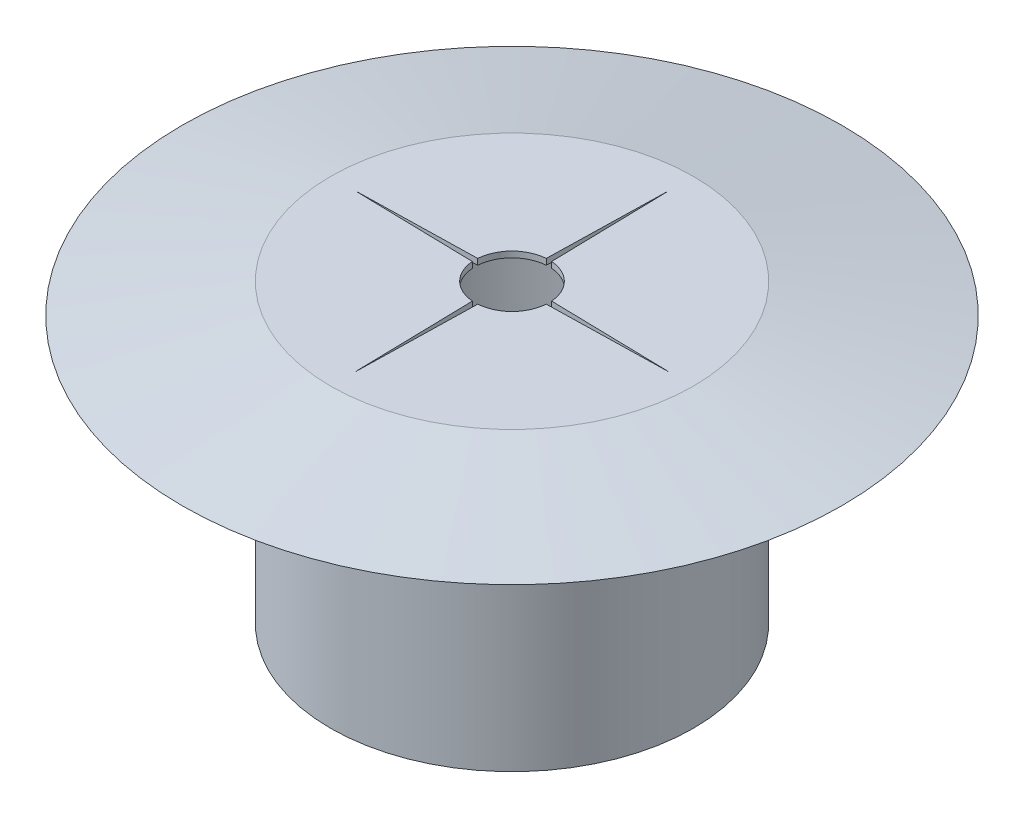
ISO-10303-21;
HEADER;
FILE_DESCRIPTION(('STEP AP214'),'2;1');
FILE_NAME('part.step','',(''),(''),'','','');
FILE_SCHEMA(('AUTOMOTIVE_DESIGN { 1 0 10303 214 1 1 1 1 }'));
ENDSEC;
DATA;
#1=APPLICATION_CONTEXT('core data for automotive mechanical design processes');
#2=APPLICATION_PROTOCOL_DEFINITION('international standard','automotive_design',2000,#1);
#3=PRODUCT_CONTEXT('',#1,'mechanical');
#4=PRODUCT('Part','Part','',(#3));
#5=PRODUCT_RELATED_PRODUCT_CATEGORY('part','',(#4));
#6=PRODUCT_DEFINITION_FORMATION('','',#4);
#7=PRODUCT_DEFINITION_CONTEXT('part definition',#1,'design');
#8=PRODUCT_DEFINITION('design','',#6,#7);
#9=PRODUCT_DEFINITION_SHAPE('','',#8);
#10=(LENGTH_UNIT() NAMED_UNIT(*) SI_UNIT(.MILLI.,.METRE.));
#11=(NAMED_UNIT(*) PLANE_ANGLE_UNIT() SI_UNIT($,.RADIAN.));
#12=(NAMED_UNIT(*) SI_UNIT($,.STERADIAN.) SOLID_ANGLE_UNIT());
#13=UNCERTAINTY_MEASURE_WITH_UNIT(LENGTH_MEASURE(1.E-05),#10,'distance_accuracy_value','');
#14=(GEOMETRIC_REPRESENTATION_CONTEXT(3) GLOBAL_UNCERTAINTY_ASSIGNED_CONTEXT((#13)) GLOBAL_UNIT_ASSIGNED_CONTEXT((#10,
#11,#12)) REPRESENTATION_CONTEXT('',''));
#15=CARTESIAN_POINT('',(0.,0.,0.));
#16=DIRECTION('',(0.,0.,1.));
#17=DIRECTION('',(1.,0.,0.));
#18=AXIS2_PLACEMENT_3D('',#15,#16,#17);
#19=CARTESIAN_POINT('',(0.,0.,0.));
#20=DIRECTION('',(0.,-1.,0.));
#21=DIRECTION('',(0.,0.,-1.));
#22=AXIS2_PLACEMENT_3D('',#19,#20,#21);
#23=CYLINDRICAL_SURFACE('',#22,10.9);
#24=CARTESIAN_POINT('',(0.,0.,0.));
#25=DIRECTION('',(0.,-1.,0.));
#26=DIRECTION('',(0.,0.,-1.));
#27=AXIS2_PLACEMENT_3D('',#24,#25,#26);
#28=CIRCLE('',#27,10.9);
#29=CARTESIAN_POINT('',(0.,0.,-10.9));
#30=VERTEX_POINT('',#29);
#31=EDGE_CURVE('E44',#30,#30,#28,.T.);
#32=ORIENTED_EDGE('',*,*,#31,.T.);
#33=EDGE_LOOP('',(#32));
#34=FACE_BOUND('',#33,.T.);
#35=CARTESIAN_POINT('',(0.,19.6,0.));
#36=DIRECTION('',(0.,1.,0.));
#37=DIRECTION('',(0.,0.,1.));
#38=AXIS2_PLACEMENT_3D('',#35,#36,#37);
#39=CIRCLE('',#38,10.9);
#40=CARTESIAN_POINT('',(0.,19.6,10.9));
#41=VERTEX_POINT('',#40);
#42=EDGE_CURVE('E11',#41,#41,#39,.F.);
#43=ORIENTED_EDGE('',*,*,#42,.F.);
#44=EDGE_LOOP('',(#43));
#45=FACE_BOUND('',#44,.T.);
#46=ADVANCED_FACE('F35',(#34,#45),#23,.F.);
#47=CARTESIAN_POINT('',(-12.25,20.,0.));
#48=DIRECTION('',(0.,-1.,0.));
#49=DIRECTION('',(0.,0.,-1.));
#50=AXIS2_PLACEMENT_3D('',#47,#48,#49);
#51=PLANE('',#50);
#52=CARTESIAN_POINT('',(0.,20.,0.));
#53=DIRECTION('',(0.,-1.,0.));
#54=DIRECTION('',(0.,0.,-1.));
#55=AXIS2_PLACEMENT_3D('',#52,#53,#54);
#56=CIRCLE('',#55,12.25);
#57=CARTESIAN_POINT('',(0.,20.,-12.25));
#58=VERTEX_POINT('',#57);
#59=EDGE_CURVE('E190',#58,#58,#56,.T.);
#60=ORIENTED_EDGE('',*,*,#59,.F.);
#61=EDGE_LOOP('',(#60));
#62=FACE_BOUND('',#61,.T.);
#63=DIRECTION('',(-0.0222490233701665,0.,-0.999752459841472));
#64=VECTOR('',#63,1.);
#65=CARTESIAN_POINT('',(0.236666949150214,20.,-0.00526691225488365));
#66=LINE('',#65,#64);
#67=CARTESIAN_POINT('',(0.181294314743964,20.,-2.49341780924127));
#68=VERTEX_POINT('',#67);
#69=CARTESIAN_POINT('',(0.,20.,-10.6398175008156));
#70=VERTEX_POINT('',#69);
#71=EDGE_CURVE('E157',#68,#70,#66,.T.);
#72=ORIENTED_EDGE('',*,*,#71,.F.);
#73=CARTESIAN_POINT('',(0.,20.,0.));
#74=DIRECTION('',(0.,1.,0.));
#75=DIRECTION('',(0.,0.,1.));
#76=AXIS2_PLACEMENT_3D('',#73,#74,#75);
#77=CIRCLE('',#76,2.5);
#78=CARTESIAN_POINT('',(2.49341780924127,20.,-0.181294314743965));
#79=VERTEX_POINT('',#78);
#80=EDGE_CURVE('E159',#68,#79,#77,.F.);
#81=ORIENTED_EDGE('',*,*,#80,.T.);
#82=DIRECTION('',(0.999752459841472,0.,0.0222490233701668));
#83=VECTOR('',#82,1.);
#84=CARTESIAN_POINT('',(0.00526691225488376,20.,-0.236666949150216));
#85=LINE('',#84,#83);
#86=CARTESIAN_POINT('',(10.6398175008156,20.,0.));
#87=VERTEX_POINT('',#86);
#88=EDGE_CURVE('E162',#79,#87,#85,.T.);
#89=ORIENTED_EDGE('',*,*,#88,.T.);
#90=DIRECTION('',(0.999752459841472,0.,-0.0222490233701658));
#91=VECTOR('',#90,1.);
#92=CARTESIAN_POINT('',(0.00526691225488346,20.,0.236666949150212));
#93=LINE('',#92,#91);
#94=CARTESIAN_POINT('',(2.49341780924127,20.,0.181294314743964));
#95=VERTEX_POINT('',#94);
#96=EDGE_CURVE('E165',#95,#87,#93,.T.);
#97=ORIENTED_EDGE('',*,*,#96,.F.);
#98=CARTESIAN_POINT('',(0.,20.,0.));
#99=DIRECTION('',(0.,1.,0.));
#100=DIRECTION('',(0.,0.,1.));
#101=AXIS2_PLACEMENT_3D('',#98,#99,#100);
#102=CIRCLE('',#101,2.50000000000002);
#103=CARTESIAN_POINT('',(0.181294314743965,20.,2.49341780924127));
#104=VERTEX_POINT('',#103);
#105=EDGE_CURVE('E168',#95,#104,#102,.F.);
#106=ORIENTED_EDGE('',*,*,#105,.T.);
#107=DIRECTION('',(-0.0222490233701662,0.,0.999752459841472));
#108=VECTOR('',#107,1.);
#109=CARTESIAN_POINT('',(0.236666949150214,20.,0.00526691225488356));
#110=LINE('',#109,#108);
#111=CARTESIAN_POINT('',(0.,20.,10.6398175008156));
#112=VERTEX_POINT('',#111);
#113=EDGE_CURVE('E171',#104,#112,#110,.T.);
#114=ORIENTED_EDGE('',*,*,#113,.T.);
#115=DIRECTION('',(0.0222490233701664,0.,0.999752459841472));
#116=VECTOR('',#115,1.);
#117=CARTESIAN_POINT('',(-0.236666949150214,20.,0.00526691225488362));
#118=LINE('',#117,#116);
#119=CARTESIAN_POINT('',(-0.181294314743964,20.,2.49341780924127));
#120=VERTEX_POINT('',#119);
#121=EDGE_CURVE('E174',#120,#112,#118,.T.);
#122=ORIENTED_EDGE('',*,*,#121,.F.);
#123=CARTESIAN_POINT('',(0.,20.,0.));
#124=DIRECTION('',(0.,1.,0.));
#125=DIRECTION('',(0.,0.,1.));
#126=AXIS2_PLACEMENT_3D('',#123,#124,#125);
#127=CIRCLE('',#126,2.5);
#128=CARTESIAN_POINT('',(-2.49341780924127,20.,0.181294314743965));
#129=VERTEX_POINT('',#128);
#130=EDGE_CURVE('E177',#120,#129,#127,.F.);
#131=ORIENTED_EDGE('',*,*,#130,.T.);
#132=DIRECTION('',(-0.999752459841472,0.,-0.0222490233701661));
#133=VECTOR('',#132,1.);
#134=CARTESIAN_POINT('',(-0.00526691225488354,20.,0.236666949150214));
#135=LINE('',#134,#133);
#136=CARTESIAN_POINT('',(-10.6398175008156,20.,0.));
#137=VERTEX_POINT('',#136);
#138=EDGE_CURVE('E180',#129,#137,#135,.T.);
#139=ORIENTED_EDGE('',*,*,#138,.T.);
#140=DIRECTION('',(-0.999752459841472,0.,0.0222490233701665));
#141=VECTOR('',#140,1.);
#142=CARTESIAN_POINT('',(-0.00526691225488363,20.,-0.236666949150214));
#143=LINE('',#142,#141);
#144=CARTESIAN_POINT('',(-2.49341780924127,20.,-0.181294314743964));
#145=VERTEX_POINT('',#144);
#146=EDGE_CURVE('E183',#145,#137,#143,.T.);
#147=ORIENTED_EDGE('',*,*,#146,.F.);
#148=CARTESIAN_POINT('',(0.,20.,0.));
#149=DIRECTION('',(0.,1.,0.));
#150=DIRECTION('',(0.,0.,1.));
#151=AXIS2_PLACEMENT_3D('',#148,#149,#150);
#152=CIRCLE('',#151,2.49999999999997);
#153=CARTESIAN_POINT('',(-0.181294314743965,20.,-2.49341780924127));
#154=VERTEX_POINT('',#153);
#155=EDGE_CURVE('E138',#145,#154,#152,.F.);
#156=ORIENTED_EDGE('',*,*,#155,.T.);
#157=DIRECTION('',(0.022249023370166,0.,-0.999752459841472));
#158=VECTOR('',#157,1.);
#159=CARTESIAN_POINT('',(-0.236666949150214,20.,-0.00526691225488353));
#160=LINE('',#159,#158);
#161=EDGE_CURVE('E186',#154,#70,#160,.T.);
#162=ORIENTED_EDGE('',*,*,#161,.T.);
#163=EDGE_LOOP('',(#72,#81,#89,#97,#106,#114,#122,#131,#139,#147,#156,#162));
#164=FACE_BOUND('',#163,.T.);
#165=ADVANCED_FACE('F37',(#62,#164),#51,.F.);
#166=CARTESIAN_POINT('',(-10.9,0.,0.));
#167=DIRECTION('',(0.,1.,0.));
#168=DIRECTION('',(0.,0.,1.));
#169=AXIS2_PLACEMENT_3D('',#166,#167,#168);
#170=PLANE('',#169);
#171=ORIENTED_EDGE('',*,*,#31,.F.);
#172=EDGE_LOOP('',(#171));
#173=FACE_BOUND('',#172,.T.);
#174=CARTESIAN_POINT('',(0.,0.,0.));
#175=DIRECTION('',(0.,-1.,0.));
#176=DIRECTION('',(0.,0.,-1.));
#177=AXIS2_PLACEMENT_3D('',#174,#175,#176);
#178=CIRCLE('',#177,12.25);
#179=CARTESIAN_POINT('',(0.,0.,-12.25));
#180=VERTEX_POINT('',#179);
#181=EDGE_CURVE('E216',#180,#180,#178,.T.);
#182=ORIENTED_EDGE('',*,*,#181,.T.);
#183=EDGE_LOOP('',(#182));
#184=FACE_BOUND('',#183,.T.);
#185=ADVANCED_FACE('F223',(#173,#184),#170,.F.);
#186=CARTESIAN_POINT('',(0.,0.,0.));
#187=DIRECTION('',(0.,-1.,0.));
#188=DIRECTION('',(0.,0.,-1.));
#189=AXIS2_PLACEMENT_3D('',#186,#187,#188);
#190=CYLINDRICAL_SURFACE('',#189,12.25);
#191=ORIENTED_EDGE('',*,*,#181,.F.);
#192=EDGE_LOOP('',(#191));
#193=FACE_BOUND('',#192,.T.);
#194=CARTESIAN_POINT('',(0.,18.,0.));
#195=DIRECTION('',(0.,-1.,0.));
#196=DIRECTION('',(0.,0.,-1.));
#197=AXIS2_PLACEMENT_3D('',#194,#195,#196);
#198=CIRCLE('',#197,12.25);
#199=CARTESIAN_POINT('',(0.,18.,-12.25));
#200=VERTEX_POINT('',#199);
#201=EDGE_CURVE('E213',#200,#200,#198,.T.);
#202=ORIENTED_EDGE('',*,*,#201,.T.);
#203=EDGE_LOOP('',(#202));
#204=FACE_BOUND('',#203,.T.);
#205=ADVANCED_FACE('F226',(#193,#204),#190,.T.);
#206=CARTESIAN_POINT('',(-12.25,18.,0.));
#207=DIRECTION('',(0.,1.,0.));
#208=DIRECTION('',(0.,0.,1.));
#209=AXIS2_PLACEMENT_3D('',#206,#207,#208);
#210=PLANE('',#209);
#211=ORIENTED_EDGE('',*,*,#201,.F.);
#212=EDGE_LOOP('',(#211));
#213=FACE_BOUND('',#212,.T.);
#214=CARTESIAN_POINT('',(0.,18.,0.));
#215=DIRECTION('',(0.,-1.,0.));
#216=DIRECTION('',(0.,0.,-1.));
#217=AXIS2_PLACEMENT_3D('',#214,#215,#216);
#218=CIRCLE('',#217,22.25);
#219=CARTESIAN_POINT('',(0.,18.,-22.25));
#220=VERTEX_POINT('',#219);
#221=EDGE_CURVE('E210',#220,#220,#218,.T.);
#222=ORIENTED_EDGE('',*,*,#221,.T.);
#223=EDGE_LOOP('',(#222));
#224=FACE_BOUND('',#223,.T.);
#225=ADVANCED_FACE('F232',(#213,#224),#210,.F.);
#226=CARTESIAN_POINT('',(0.,20.,0.));
#227=DIRECTION('',(0.,-1.,0.));
#228=DIRECTION('',(0.,0.,-1.));
#229=AXIS2_PLACEMENT_3D('',#226,#227,#228);
#230=CONICAL_SURFACE('',#229,12.25,1.37340076694502);
#231=ORIENTED_EDGE('',*,*,#221,.F.);
#232=EDGE_LOOP('',(#231));
#233=FACE_BOUND('',#232,.T.);
#234=ORIENTED_EDGE('',*,*,#59,.T.);
#235=EDGE_LOOP('',(#234));
#236=FACE_BOUND('',#235,.T.);
#237=ADVANCED_FACE('F238',(#233,#236),#230,.T.);
#238=CARTESIAN_POINT('',(0.236666949150214,19.6,-0.00526691225488365));
#239=DIRECTION('',(0.999752459841472,0.,-0.0222490233701665));
#240=DIRECTION('',(-0.0222490233701665,0.,-0.999752459841472));
#241=AXIS2_PLACEMENT_3D('',#238,#239,#240);
#242=PLANE('',#241);
#243=ORIENTED_EDGE('',*,*,#71,.T.);
#244=DIRECTION('',(0.,1.,0.));
#245=VECTOR('',#244,1.);
#246=CARTESIAN_POINT('',(0.,19.6,-10.6398175008156));
#247=LINE('',#246,#245);
#248=CARTESIAN_POINT('',(0.,19.6,-10.6398175008156));
#249=VERTEX_POINT('',#248);
#250=EDGE_CURVE('E100',#249,#70,#247,.T.);
#251=ORIENTED_EDGE('',*,*,#250,.F.);
#252=DIRECTION('',(-0.0222490233701665,0.,-0.999752459841472));
#253=VECTOR('',#252,1.);
#254=CARTESIAN_POINT('',(0.236666949150214,19.6,-0.00526691225488365));
#255=LINE('',#254,#253);
#256=CARTESIAN_POINT('',(0.181294314743964,19.6,-2.49341780924127));
#257=VERTEX_POINT('',#256);
#258=EDGE_CURVE('E52',#257,#249,#255,.T.);
#259=ORIENTED_EDGE('',*,*,#258,.F.);
#260=DIRECTION('',(0.,1.,0.));
#261=VECTOR('',#260,1.);
#262=CARTESIAN_POINT('',(0.181294314743964,19.6,-2.49341780924127));
#263=LINE('',#262,#261);
#264=EDGE_CURVE('E108',#257,#68,#263,.T.);
#265=ORIENTED_EDGE('',*,*,#264,.T.);
#266=EDGE_LOOP('',(#243,#251,#259,#265));
#267=FACE_BOUND('',#266,.T.);
#268=ADVANCED_FACE('F244',(#267),#242,.F.);
#269=CARTESIAN_POINT('',(-0.236666949150214,19.6,-0.00526691225488353));
#270=DIRECTION('',(0.999752459841472,0.,0.022249023370166));
#271=DIRECTION('',(0.022249023370166,0.,-0.999752459841472));
#272=AXIS2_PLACEMENT_3D('',#269,#270,#271);
#273=PLANE('',#272);
#274=ORIENTED_EDGE('',*,*,#161,.F.);
#275=DIRECTION('',(0.,1.,0.));
#276=VECTOR('',#275,1.);
#277=CARTESIAN_POINT('',(-0.181294314743965,19.6,-2.49341780924127));
#278=LINE('',#277,#276);
#279=CARTESIAN_POINT('',(-0.181294314743965,19.6,-2.49341780924127));
#280=VERTEX_POINT('',#279);
#281=EDGE_CURVE('E93',#280,#154,#278,.T.);
#282=ORIENTED_EDGE('',*,*,#281,.F.);
#283=DIRECTION('',(0.022249023370166,0.,-0.999752459841472));
#284=VECTOR('',#283,1.);
#285=CARTESIAN_POINT('',(-0.236666949150214,19.6,-0.00526691225488353));
#286=LINE('',#285,#284);
#287=EDGE_CURVE('E152',#280,#249,#286,.T.);
#288=ORIENTED_EDGE('',*,*,#287,.T.);
#289=ORIENTED_EDGE('',*,*,#250,.T.);
#290=EDGE_LOOP('',(#274,#282,#288,#289));
#291=FACE_BOUND('',#290,.T.);
#292=ADVANCED_FACE('F287',(#291),#273,.T.);
#293=CARTESIAN_POINT('',(0.,19.6,0.));
#294=DIRECTION('',(0.,1.,0.));
#295=DIRECTION('',(0.,0.,1.));
#296=AXIS2_PLACEMENT_3D('',#293,#294,#295);
#297=CYLINDRICAL_SURFACE('',#296,2.49999999999997);
#298=ORIENTED_EDGE('',*,*,#155,.F.);
#299=DIRECTION('',(0.,1.,0.));
#300=VECTOR('',#299,1.);
#301=CARTESIAN_POINT('',(-2.49341780924127,19.6,-0.181294314743964));
#302=LINE('',#301,#300);
#303=CARTESIAN_POINT('',(-2.49341780924127,19.6,-0.181294314743964));
#304=VERTEX_POINT('',#303);
#305=EDGE_CURVE('E133',#304,#145,#302,.T.);
#306=ORIENTED_EDGE('',*,*,#305,.F.);
#307=CARTESIAN_POINT('',(0.,19.6,0.));
#308=DIRECTION('',(0.,1.,0.));
#309=DIRECTION('',(0.,0.,1.));
#310=AXIS2_PLACEMENT_3D('',#307,#308,#309);
#311=CIRCLE('',#310,2.49999999999997);
#312=EDGE_CURVE('E137',#304,#280,#311,.F.);
#313=ORIENTED_EDGE('',*,*,#312,.T.);
#314=ORIENTED_EDGE('',*,*,#281,.T.);
#315=EDGE_LOOP('',(#298,#306,#313,#314));
#316=FACE_BOUND('',#315,.T.);
#317=ADVANCED_FACE('F135',(#316),#297,.F.);
#318=CARTESIAN_POINT('',(-0.00526691225488363,19.6,-0.236666949150214));
#319=DIRECTION('',(-0.0222490233701665,0.,-0.999752459841472));
#320=DIRECTION('',(-0.999752459841472,0.,0.0222490233701665));
#321=AXIS2_PLACEMENT_3D('',#318,#319,#320);
#322=PLANE('',#321);
#323=ORIENTED_EDGE('',*,*,#146,.T.);
#324=DIRECTION('',(0.,1.,0.));
#325=VECTOR('',#324,1.);
#326=CARTESIAN_POINT('',(-10.6398175008156,19.6,0.));
#327=LINE('',#326,#325);
#328=CARTESIAN_POINT('',(-10.6398175008156,19.6,0.));
#329=VERTEX_POINT('',#328);
#330=EDGE_CURVE('E142',#329,#137,#327,.T.);
#331=ORIENTED_EDGE('',*,*,#330,.F.);
#332=DIRECTION('',(-0.999752459841472,0.,0.0222490233701665));
#333=VECTOR('',#332,1.);
#334=CARTESIAN_POINT('',(-0.00526691225488363,19.6,-0.236666949150214));
#335=LINE('',#334,#333);
#336=EDGE_CURVE('E145',#304,#329,#335,.T.);
#337=ORIENTED_EDGE('',*,*,#336,.F.);
#338=ORIENTED_EDGE('',*,*,#305,.T.);
#339=EDGE_LOOP('',(#323,#331,#337,#338));
#340=FACE_BOUND('',#339,.T.);
#341=ADVANCED_FACE('F146',(#340),#322,.F.);
#342=CARTESIAN_POINT('',(-0.00526691225488354,19.6,0.236666949150214));
#343=DIRECTION('',(0.0222490233701661,0.,-0.999752459841472));
#344=DIRECTION('',(-0.999752459841472,0.,-0.0222490233701661));
#345=AXIS2_PLACEMENT_3D('',#342,#343,#344);
#346=PLANE('',#345);
#347=ORIENTED_EDGE('',*,*,#138,.F.);
#348=DIRECTION('',(0.,1.,0.));
#349=VECTOR('',#348,1.);
#350=CARTESIAN_POINT('',(-2.49341780924127,19.6,0.181294314743965));
#351=LINE('',#350,#349);
#352=CARTESIAN_POINT('',(-2.49341780924127,19.6,0.181294314743965));
#353=VERTEX_POINT('',#352);
#354=EDGE_CURVE('E193',#353,#129,#351,.T.);
#355=ORIENTED_EDGE('',*,*,#354,.F.);
#356=DIRECTION('',(-0.999752459841472,0.,-0.0222490233701661));
#357=VECTOR('',#356,1.);
#358=CARTESIAN_POINT('',(-0.00526691225488354,19.6,0.236666949150214));
#359=LINE('',#358,#357);
#360=EDGE_CURVE('E149',#353,#329,#359,.T.);
#361=ORIENTED_EDGE('',*,*,#360,.T.);
#362=ORIENTED_EDGE('',*,*,#330,.T.);
#363=EDGE_LOOP('',(#347,#355,#361,#362));
#364=FACE_BOUND('',#363,.T.);
#365=ADVANCED_FACE('F286',(#364),#346,.T.);
#366=CARTESIAN_POINT('',(0.,19.6,0.));
#367=DIRECTION('',(0.,1.,0.));
#368=DIRECTION('',(0.,0.,1.));
#369=AXIS2_PLACEMENT_3D('',#366,#367,#368);
#370=CYLINDRICAL_SURFACE('',#369,2.5);
#371=ORIENTED_EDGE('',*,*,#130,.F.);
#372=DIRECTION('',(0.,1.,0.));
#373=VECTOR('',#372,1.);
#374=CARTESIAN_POINT('',(-0.181294314743964,19.6,2.49341780924127));
#375=LINE('',#374,#373);
#376=CARTESIAN_POINT('',(-0.181294314743964,19.6,2.49341780924127));
#377=VERTEX_POINT('',#376);
#378=EDGE_CURVE('E195',#377,#120,#375,.T.);
#379=ORIENTED_EDGE('',*,*,#378,.F.);
#380=CARTESIAN_POINT('',(0.,19.6,0.));
#381=DIRECTION('',(0.,1.,0.));
#382=DIRECTION('',(0.,0.,1.));
#383=AXIS2_PLACEMENT_3D('',#380,#381,#382);
#384=CIRCLE('',#383,2.5);
#385=EDGE_CURVE('E284',#377,#353,#384,.F.);
#386=ORIENTED_EDGE('',*,*,#385,.T.);
#387=ORIENTED_EDGE('',*,*,#354,.T.);
#388=EDGE_LOOP('',(#371,#379,#386,#387));
#389=FACE_BOUND('',#388,.T.);
#390=ADVANCED_FACE('F279',(#389),#370,.F.);
#391=CARTESIAN_POINT('',(-0.236666949150214,19.6,0.00526691225488362));
#392=DIRECTION('',(-0.999752459841472,0.,0.0222490233701664));
#393=DIRECTION('',(0.0222490233701664,0.,0.999752459841472));
#394=AXIS2_PLACEMENT_3D('',#391,#392,#393);
#395=PLANE('',#394);
#396=ORIENTED_EDGE('',*,*,#121,.T.);
#397=DIRECTION('',(0.,1.,0.));
#398=VECTOR('',#397,1.);
#399=CARTESIAN_POINT('',(0.,19.6,10.6398175008156));
#400=LINE('',#399,#398);
#401=CARTESIAN_POINT('',(0.,19.6,10.6398175008156));
#402=VERTEX_POINT('',#401);
#403=EDGE_CURVE('E197',#402,#112,#400,.T.);
#404=ORIENTED_EDGE('',*,*,#403,.F.);
#405=DIRECTION('',(0.0222490233701664,0.,0.999752459841472));
#406=VECTOR('',#405,1.);
#407=CARTESIAN_POINT('',(-0.236666949150214,19.6,0.00526691225488362));
#408=LINE('',#407,#406);
#409=EDGE_CURVE('E436',#377,#402,#408,.T.);
#410=ORIENTED_EDGE('',*,*,#409,.F.);
#411=ORIENTED_EDGE('',*,*,#378,.T.);
#412=EDGE_LOOP('',(#396,#404,#410,#411));
#413=FACE_BOUND('',#412,.T.);
#414=ADVANCED_FACE('F312',(#413),#395,.F.);
#415=CARTESIAN_POINT('',(0.236666949150214,19.6,0.00526691225488356));
#416=DIRECTION('',(-0.999752459841472,0.,-0.0222490233701662));
#417=DIRECTION('',(-0.0222490233701662,0.,0.999752459841472));
#418=AXIS2_PLACEMENT_3D('',#415,#416,#417);
#419=PLANE('',#418);
#420=ORIENTED_EDGE('',*,*,#113,.F.);
#421=DIRECTION('',(0.,1.,0.));
#422=VECTOR('',#421,1.);
#423=CARTESIAN_POINT('',(0.181294314743965,19.6,2.49341780924127));
#424=LINE('',#423,#422);
#425=CARTESIAN_POINT('',(0.181294314743965,19.6,2.49341780924127));
#426=VERTEX_POINT('',#425);
#427=EDGE_CURVE('E199',#426,#104,#424,.T.);
#428=ORIENTED_EDGE('',*,*,#427,.F.);
#429=DIRECTION('',(-0.0222490233701662,0.,0.999752459841472));
#430=VECTOR('',#429,1.);
#431=CARTESIAN_POINT('',(0.236666949150214,19.6,0.00526691225488356));
#432=LINE('',#431,#430);
#433=EDGE_CURVE('E440',#426,#402,#432,.T.);
#434=ORIENTED_EDGE('',*,*,#433,.T.);
#435=ORIENTED_EDGE('',*,*,#403,.T.);
#436=EDGE_LOOP('',(#420,#428,#434,#435));
#437=FACE_BOUND('',#436,.T.);
#438=ADVANCED_FACE('F273',(#437),#419,.T.);
#439=CARTESIAN_POINT('',(0.,19.6,0.));
#440=DIRECTION('',(0.,1.,0.));
#441=DIRECTION('',(0.,0.,1.));
#442=AXIS2_PLACEMENT_3D('',#439,#440,#441);
#443=CYLINDRICAL_SURFACE('',#442,2.50000000000002);
#444=ORIENTED_EDGE('',*,*,#105,.F.);
#445=DIRECTION('',(0.,1.,0.));
#446=VECTOR('',#445,1.);
#447=CARTESIAN_POINT('',(2.49341780924127,19.6,0.181294314743964));
#448=LINE('',#447,#446);
#449=CARTESIAN_POINT('',(2.49341780924127,19.6,0.181294314743964));
#450=VERTEX_POINT('',#449);
#451=EDGE_CURVE('E201',#450,#95,#448,.T.);
#452=ORIENTED_EDGE('',*,*,#451,.F.);
#453=CARTESIAN_POINT('',(0.,19.6,0.));
#454=DIRECTION('',(0.,1.,0.));
#455=DIRECTION('',(0.,0.,1.));
#456=AXIS2_PLACEMENT_3D('',#453,#454,#455);
#457=CIRCLE('',#456,2.50000000000002);
#458=EDGE_CURVE('E269',#450,#426,#457,.F.);
#459=ORIENTED_EDGE('',*,*,#458,.T.);
#460=ORIENTED_EDGE('',*,*,#427,.T.);
#461=EDGE_LOOP('',(#444,#452,#459,#460));
#462=FACE_BOUND('',#461,.T.);
#463=ADVANCED_FACE('F264',(#462),#443,.F.);
#464=CARTESIAN_POINT('',(0.00526691225488346,19.6,0.236666949150212));
#465=DIRECTION('',(0.0222490233701658,0.,0.999752459841472));
#466=DIRECTION('',(0.999752459841472,0.,-0.0222490233701658));
#467=AXIS2_PLACEMENT_3D('',#464,#465,#466);
#468=PLANE('',#467);
#469=ORIENTED_EDGE('',*,*,#96,.T.);
#470=DIRECTION('',(0.,1.,0.));
#471=VECTOR('',#470,1.);
#472=CARTESIAN_POINT('',(10.6398175008156,19.6,0.));
#473=LINE('',#472,#471);
#474=CARTESIAN_POINT('',(10.6398175008156,19.6,0.));
#475=VERTEX_POINT('',#474);
#476=EDGE_CURVE('E203',#475,#87,#473,.T.);
#477=ORIENTED_EDGE('',*,*,#476,.F.);
#478=DIRECTION('',(0.999752459841472,0.,-0.0222490233701658));
#479=VECTOR('',#478,1.);
#480=CARTESIAN_POINT('',(0.00526691225488346,19.6,0.236666949150212));
#481=LINE('',#480,#479);
#482=EDGE_CURVE('E443',#450,#475,#481,.T.);
#483=ORIENTED_EDGE('',*,*,#482,.F.);
#484=ORIENTED_EDGE('',*,*,#451,.T.);
#485=EDGE_LOOP('',(#469,#477,#483,#484));
#486=FACE_BOUND('',#485,.T.);
#487=ADVANCED_FACE('F305',(#486),#468,.F.);
#488=CARTESIAN_POINT('',(0.00526691225488376,19.6,-0.236666949150216));
#489=DIRECTION('',(-0.0222490233701668,0.,0.999752459841472));
#490=DIRECTION('',(0.999752459841472,0.,0.0222490233701668));
#491=AXIS2_PLACEMENT_3D('',#488,#489,#490);
#492=PLANE('',#491);
#493=ORIENTED_EDGE('',*,*,#88,.F.);
#494=DIRECTION('',(0.,1.,0.));
#495=VECTOR('',#494,1.);
#496=CARTESIAN_POINT('',(2.49341780924127,19.6,-0.181294314743965));
#497=LINE('',#496,#495);
#498=CARTESIAN_POINT('',(2.49341780924127,19.6,-0.181294314743965));
#499=VERTEX_POINT('',#498);
#500=EDGE_CURVE('E205',#499,#79,#497,.T.);
#501=ORIENTED_EDGE('',*,*,#500,.F.);
#502=DIRECTION('',(0.999752459841472,0.,0.0222490233701668));
#503=VECTOR('',#502,1.);
#504=CARTESIAN_POINT('',(0.00526691225488376,19.6,-0.236666949150216));
#505=LINE('',#504,#503);
#506=EDGE_CURVE('E445',#499,#475,#505,.T.);
#507=ORIENTED_EDGE('',*,*,#506,.T.);
#508=ORIENTED_EDGE('',*,*,#476,.T.);
#509=EDGE_LOOP('',(#493,#501,#507,#508));
#510=FACE_BOUND('',#509,.T.);
#511=ADVANCED_FACE('F258',(#510),#492,.T.);
#512=CARTESIAN_POINT('',(0.,19.6,0.));
#513=DIRECTION('',(0.,1.,0.));
#514=DIRECTION('',(0.,0.,1.));
#515=AXIS2_PLACEMENT_3D('',#512,#513,#514);
#516=CYLINDRICAL_SURFACE('',#515,2.5);
#517=ORIENTED_EDGE('',*,*,#80,.F.);
#518=ORIENTED_EDGE('',*,*,#264,.F.);
#519=CARTESIAN_POINT('',(0.,19.6,0.));
#520=DIRECTION('',(0.,1.,0.));
#521=DIRECTION('',(0.,0.,1.));
#522=AXIS2_PLACEMENT_3D('',#519,#520,#521);
#523=CIRCLE('',#522,2.5);
#524=EDGE_CURVE('E254',#257,#499,#523,.F.);
#525=ORIENTED_EDGE('',*,*,#524,.T.);
#526=ORIENTED_EDGE('',*,*,#500,.T.);
#527=EDGE_LOOP('',(#517,#518,#525,#526));
#528=FACE_BOUND('',#527,.T.);
#529=ADVANCED_FACE('F252',(#528),#516,.F.);
#530=CARTESIAN_POINT('',(0.,19.6,0.));
#531=DIRECTION('',(0.,1.,0.));
#532=DIRECTION('',(0.,0.,1.));
#533=AXIS2_PLACEMENT_3D('',#530,#531,#532);
#534=PLANE('',#533);
#535=ORIENTED_EDGE('',*,*,#42,.T.);
#536=EDGE_LOOP('',(#535));
#537=FACE_BOUND('',#536,.T.);
#538=ORIENTED_EDGE('',*,*,#258,.T.);
#539=ORIENTED_EDGE('',*,*,#287,.F.);
#540=ORIENTED_EDGE('',*,*,#312,.F.);
#541=ORIENTED_EDGE('',*,*,#336,.T.);
#542=ORIENTED_EDGE('',*,*,#360,.F.);
#543=ORIENTED_EDGE('',*,*,#385,.F.);
#544=ORIENTED_EDGE('',*,*,#409,.T.);
#545=ORIENTED_EDGE('',*,*,#433,.F.);
#546=ORIENTED_EDGE('',*,*,#458,.F.);
#547=ORIENTED_EDGE('',*,*,#482,.T.);
#548=ORIENTED_EDGE('',*,*,#506,.F.);
#549=ORIENTED_EDGE('',*,*,#524,.F.);
#550=EDGE_LOOP('',(#538,#539,#540,#541,#542,#543,#544,#545,#546,#547,#548,#549));
#551=FACE_BOUND('',#550,.T.);
#552=ADVANCED_FACE('F151',(#537,#551),#534,.F.);
#553=CLOSED_SHELL('',(#46,#165,#185,#205,#225,#237,#268,#292,#317,#341,#365,#390,#414,#438,#463,
#487,#511,#529,#552));
#554=MANIFOLD_SOLID_BREP('B2',#553);
#555=ADVANCED_BREP_SHAPE_REPRESENTATION('',(#18,#554),#14);
#556=SHAPE_DEFINITION_REPRESENTATION(#9,#555);
ENDSEC;
END-ISO-10303-21;
